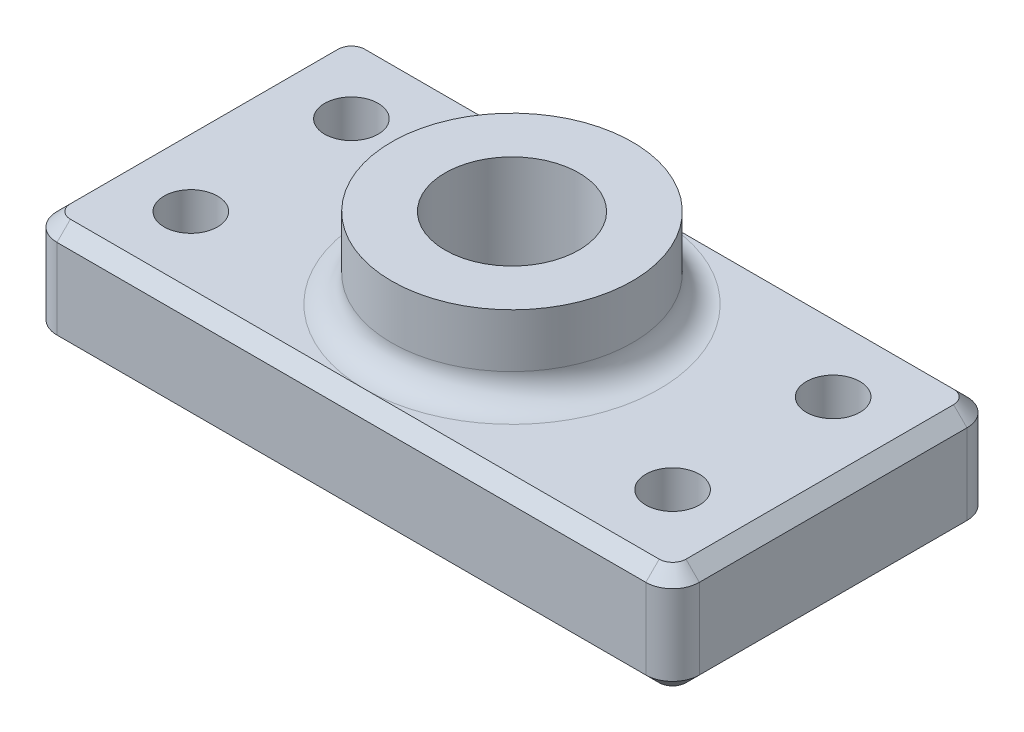
ISO-10303-21;
HEADER;
FILE_DESCRIPTION(('STEP AP214'),'2;1');
FILE_NAME('part.step','',(''),(''),'','','');
FILE_SCHEMA(('AUTOMOTIVE_DESIGN { 1 0 10303 214 1 1 1 1 }'));
ENDSEC;
DATA;
#1=APPLICATION_CONTEXT('core data for automotive mechanical design processes');
#2=APPLICATION_PROTOCOL_DEFINITION('international standard','automotive_design',2000,#1);
#3=PRODUCT_CONTEXT('',#1,'mechanical');
#4=PRODUCT('Part','Part','',(#3));
#5=PRODUCT_RELATED_PRODUCT_CATEGORY('part','',(#4));
#6=PRODUCT_DEFINITION_FORMATION('','',#4);
#7=PRODUCT_DEFINITION_CONTEXT('part definition',#1,'design');
#8=PRODUCT_DEFINITION('design','',#6,#7);
#9=PRODUCT_DEFINITION_SHAPE('','',#8);
#10=(LENGTH_UNIT() NAMED_UNIT(*) SI_UNIT(.MILLI.,.METRE.));
#11=(NAMED_UNIT(*) PLANE_ANGLE_UNIT() SI_UNIT($,.RADIAN.));
#12=(NAMED_UNIT(*) SI_UNIT($,.STERADIAN.) SOLID_ANGLE_UNIT());
#13=UNCERTAINTY_MEASURE_WITH_UNIT(LENGTH_MEASURE(1.E-05),#10,'distance_accuracy_value','');
#14=(GEOMETRIC_REPRESENTATION_CONTEXT(3) GLOBAL_UNCERTAINTY_ASSIGNED_CONTEXT((#13)) GLOBAL_UNIT_ASSIGNED_CONTEXT((#10,
#11,#12)) REPRESENTATION_CONTEXT('',''));
#15=CARTESIAN_POINT('',(0.,0.,0.));
#16=DIRECTION('',(0.,0.,1.));
#17=DIRECTION('',(1.,0.,0.));
#18=AXIS2_PLACEMENT_3D('',#15,#16,#17);
#19=CARTESIAN_POINT('',(0.,1.,0.));
#20=DIRECTION('',(0.,1.,0.));
#21=DIRECTION('',(0.,0.,1.));
#22=AXIS2_PLACEMENT_3D('',#19,#20,#21);
#23=PLANE('',#22);
#24=CARTESIAN_POINT('',(2.25,1.,0.75));
#25=DIRECTION('',(0.,1.,0.));
#26=DIRECTION('',(0.,0.,1.));
#27=AXIS2_PLACEMENT_3D('',#24,#25,#26);
#28=CIRCLE('',#27,0.25);
#29=CARTESIAN_POINT('',(2.25,1.,1.));
#30=VERTEX_POINT('',#29);
#31=EDGE_CURVE('E400',#30,#30,#28,.T.);
#32=ORIENTED_EDGE('',*,*,#31,.F.);
#33=EDGE_LOOP('',(#32));
#34=FACE_BOUND('',#33,.T.);
#35=CARTESIAN_POINT('',(2.25,1.,-0.75));
#36=DIRECTION('',(0.,1.,0.));
#37=DIRECTION('',(0.,0.,1.));
#38=AXIS2_PLACEMENT_3D('',#35,#36,#37);
#39=CIRCLE('',#38,0.25);
#40=CARTESIAN_POINT('',(2.25,1.,-0.5));
#41=VERTEX_POINT('',#40);
#42=EDGE_CURVE('E417',#41,#41,#39,.T.);
#43=ORIENTED_EDGE('',*,*,#42,.F.);
#44=EDGE_LOOP('',(#43));
#45=FACE_BOUND('',#44,.T.);
#46=CARTESIAN_POINT('',(2.75,1.,-1.25));
#47=DIRECTION('',(0.,1.,0.));
#48=DIRECTION('',(0.,0.,1.));
#49=AXIS2_PLACEMENT_3D('',#46,#47,#48);
#50=CIRCLE('',#49,0.125000000000001);
#51=CARTESIAN_POINT('',(2.875,1.,-1.25));
#52=VERTEX_POINT('',#51);
#53=CARTESIAN_POINT('',(2.75,1.,-1.375));
#54=VERTEX_POINT('',#53);
#55=EDGE_CURVE('E58',#52,#54,#50,.T.);
#56=ORIENTED_EDGE('',*,*,#55,.T.);
#57=DIRECTION('',(-1.,0.,0.));
#58=VECTOR('',#57,1.);
#59=CARTESIAN_POINT('',(-2.75,1.,-1.375));
#60=LINE('',#59,#58);
#61=CARTESIAN_POINT('',(0.,1.,-1.375));
#62=VERTEX_POINT('',#61);
#63=EDGE_CURVE('E11',#54,#62,#60,.T.);
#64=ORIENTED_EDGE('',*,*,#63,.T.);
#65=CARTESIAN_POINT('',(0.,1.,0.));
#66=DIRECTION('',(0.,1.,0.));
#67=DIRECTION('',(0.,0.,1.));
#68=AXIS2_PLACEMENT_3D('',#65,#66,#67);
#69=CIRCLE('',#68,1.375);
#70=CARTESIAN_POINT('',(0.,1.,1.375));
#71=VERTEX_POINT('',#70);
#72=EDGE_CURVE('E386',#62,#71,#69,.F.);
#73=ORIENTED_EDGE('',*,*,#72,.T.);
#74=DIRECTION('',(1.,0.,0.));
#75=VECTOR('',#74,1.);
#76=CARTESIAN_POINT('',(2.75,1.,1.375));
#77=LINE('',#76,#75);
#78=CARTESIAN_POINT('',(2.75,1.,1.375));
#79=VERTEX_POINT('',#78);
#80=EDGE_CURVE('E250',#71,#79,#77,.T.);
#81=ORIENTED_EDGE('',*,*,#80,.T.);
#82=CARTESIAN_POINT('',(2.75,1.,1.25));
#83=DIRECTION('',(0.,1.,0.));
#84=DIRECTION('',(0.,0.,1.));
#85=AXIS2_PLACEMENT_3D('',#82,#83,#84);
#86=CIRCLE('',#85,0.125000000000001);
#87=CARTESIAN_POINT('',(2.875,1.,1.25));
#88=VERTEX_POINT('',#87);
#89=EDGE_CURVE('E254',#79,#88,#86,.T.);
#90=ORIENTED_EDGE('',*,*,#89,.T.);
#91=DIRECTION('',(0.,0.,-1.));
#92=VECTOR('',#91,1.);
#93=CARTESIAN_POINT('',(2.875,1.,-1.25));
#94=LINE('',#93,#92);
#95=EDGE_CURVE('E258',#88,#52,#94,.T.);
#96=ORIENTED_EDGE('',*,*,#95,.T.);
#97=EDGE_LOOP('',(#56,#64,#73,#81,#90,#96));
#98=FACE_BOUND('',#97,.T.);
#99=ADVANCED_FACE('F35',(#34,#45,#98),#23,.T.);
#100=CARTESIAN_POINT('',(3.,1.,-1.5));
#101=DIRECTION('',(-1.,0.,0.));
#102=DIRECTION('',(0.,0.,1.));
#103=AXIS2_PLACEMENT_3D('',#100,#101,#102);
#104=PLANE('',#103);
#105=DIRECTION('',(0.,-1.,0.));
#106=VECTOR('',#105,1.);
#107=CARTESIAN_POINT('',(3.,1.,1.25));
#108=LINE('',#107,#106);
#109=CARTESIAN_POINT('',(3.,0.875000000000001,1.25));
#110=VERTEX_POINT('',#109);
#111=CARTESIAN_POINT('',(3.,0.125,1.25));
#112=VERTEX_POINT('',#111);
#113=EDGE_CURVE('E186',#110,#112,#108,.T.);
#114=ORIENTED_EDGE('',*,*,#113,.T.);
#115=DIRECTION('',(0.,0.,-1.));
#116=VECTOR('',#115,1.);
#117=CARTESIAN_POINT('',(3.,0.125,-1.5));
#118=LINE('',#117,#116);
#119=CARTESIAN_POINT('',(3.,0.125,-1.25));
#120=VERTEX_POINT('',#119);
#121=EDGE_CURVE('E160',#112,#120,#118,.T.);
#122=ORIENTED_EDGE('',*,*,#121,.T.);
#123=DIRECTION('',(0.,-1.,0.));
#124=VECTOR('',#123,1.);
#125=CARTESIAN_POINT('',(3.,1.,-1.25));
#126=LINE('',#125,#124);
#127=CARTESIAN_POINT('',(3.,0.875000000000001,-1.25));
#128=VERTEX_POINT('',#127);
#129=EDGE_CURVE('E183',#120,#128,#126,.F.);
#130=ORIENTED_EDGE('',*,*,#129,.T.);
#131=DIRECTION('',(0.,0.,1.));
#132=VECTOR('',#131,1.);
#133=CARTESIAN_POINT('',(3.,0.875000000000001,1.25));
#134=LINE('',#133,#132);
#135=EDGE_CURVE('E189',#128,#110,#134,.T.);
#136=ORIENTED_EDGE('',*,*,#135,.T.);
#137=EDGE_LOOP('',(#114,#122,#130,#136));
#138=FACE_BOUND('',#137,.T.);
#139=ADVANCED_FACE('F182',(#138),#104,.F.);
#140=CARTESIAN_POINT('',(-3.,1.,-1.5));
#141=DIRECTION('',(0.,0.,1.));
#142=DIRECTION('',(1.,0.,0.));
#143=AXIS2_PLACEMENT_3D('',#140,#141,#142);
#144=PLANE('',#143);
#145=DIRECTION('',(0.,-1.,0.));
#146=VECTOR('',#145,1.);
#147=CARTESIAN_POINT('',(2.75,1.,-1.5));
#148=LINE('',#147,#146);
#149=CARTESIAN_POINT('',(2.75,0.875000000000001,-1.5));
#150=VERTEX_POINT('',#149);
#151=CARTESIAN_POINT('',(2.75,0.125,-1.5));
#152=VERTEX_POINT('',#151);
#153=EDGE_CURVE('E198',#150,#152,#148,.T.);
#154=ORIENTED_EDGE('',*,*,#153,.T.);
#155=DIRECTION('',(-1.,0.,0.));
#156=VECTOR('',#155,1.);
#157=CARTESIAN_POINT('',(-3.,0.125,-1.5));
#158=LINE('',#157,#156);
#159=CARTESIAN_POINT('',(-2.75,0.125,-1.5));
#160=VERTEX_POINT('',#159);
#161=EDGE_CURVE('E232',#152,#160,#158,.T.);
#162=ORIENTED_EDGE('',*,*,#161,.T.);
#163=DIRECTION('',(0.,-1.,0.));
#164=VECTOR('',#163,1.);
#165=CARTESIAN_POINT('',(-2.75,1.,-1.5));
#166=LINE('',#165,#164);
#167=CARTESIAN_POINT('',(-2.75,0.875000000000001,-1.5));
#168=VERTEX_POINT('',#167);
#169=EDGE_CURVE('E354',#160,#168,#166,.F.);
#170=ORIENTED_EDGE('',*,*,#169,.T.);
#171=DIRECTION('',(1.,0.,0.));
#172=VECTOR('',#171,1.);
#173=CARTESIAN_POINT('',(2.75,0.875000000000001,-1.5));
#174=LINE('',#173,#172);
#175=EDGE_CURVE('E229',#168,#150,#174,.T.);
#176=ORIENTED_EDGE('',*,*,#175,.T.);
#177=EDGE_LOOP('',(#154,#162,#170,#176));
#178=FACE_BOUND('',#177,.T.);
#179=ADVANCED_FACE('F353',(#178),#144,.F.);
#180=CARTESIAN_POINT('',(-3.,1.,-1.5));
#181=DIRECTION('',(1.,0.,0.));
#182=DIRECTION('',(0.,0.,-1.));
#183=AXIS2_PLACEMENT_3D('',#180,#181,#182);
#184=PLANE('',#183);
#185=DIRECTION('',(0.,-1.,0.));
#186=VECTOR('',#185,1.);
#187=CARTESIAN_POINT('',(-3.,1.,-1.25));
#188=LINE('',#187,#186);
#189=CARTESIAN_POINT('',(-3.,0.875000000000001,-1.25));
#190=VERTEX_POINT('',#189);
#191=CARTESIAN_POINT('',(-3.,0.125,-1.25));
#192=VERTEX_POINT('',#191);
#193=EDGE_CURVE('E204',#190,#192,#188,.T.);
#194=ORIENTED_EDGE('',*,*,#193,.T.);
#195=DIRECTION('',(0.,0.,1.));
#196=VECTOR('',#195,1.);
#197=CARTESIAN_POINT('',(-3.,0.125,-1.5));
#198=LINE('',#197,#196);
#199=CARTESIAN_POINT('',(-3.,0.125,1.25));
#200=VERTEX_POINT('',#199);
#201=EDGE_CURVE('E248',#192,#200,#198,.T.);
#202=ORIENTED_EDGE('',*,*,#201,.T.);
#203=DIRECTION('',(0.,-1.,0.));
#204=VECTOR('',#203,1.);
#205=CARTESIAN_POINT('',(-3.,1.,1.25));
#206=LINE('',#205,#204);
#207=CARTESIAN_POINT('',(-3.,0.875000000000001,1.25));
#208=VERTEX_POINT('',#207);
#209=EDGE_CURVE('E207',#200,#208,#206,.F.);
#210=ORIENTED_EDGE('',*,*,#209,.T.);
#211=DIRECTION('',(0.,0.,-1.));
#212=VECTOR('',#211,1.);
#213=CARTESIAN_POINT('',(-3.,0.875000000000001,-1.25));
#214=LINE('',#213,#212);
#215=EDGE_CURVE('E246',#208,#190,#214,.T.);
#216=ORIENTED_EDGE('',*,*,#215,.T.);
#217=EDGE_LOOP('',(#194,#202,#210,#216));
#218=FACE_BOUND('',#217,.T.);
#219=ADVANCED_FACE('F371',(#218),#184,.F.);
#220=CARTESIAN_POINT('',(-3.,1.,1.5));
#221=DIRECTION('',(0.,0.,-1.));
#222=DIRECTION('',(-1.,0.,0.));
#223=AXIS2_PLACEMENT_3D('',#220,#221,#222);
#224=PLANE('',#223);
#225=DIRECTION('',(0.,-1.,0.));
#226=VECTOR('',#225,1.);
#227=CARTESIAN_POINT('',(-2.75,1.,1.5));
#228=LINE('',#227,#226);
#229=CARTESIAN_POINT('',(-2.75,0.875000000000001,1.5));
#230=VERTEX_POINT('',#229);
#231=CARTESIAN_POINT('',(-2.75,0.125,1.5));
#232=VERTEX_POINT('',#231);
#233=EDGE_CURVE('E193',#230,#232,#228,.T.);
#234=ORIENTED_EDGE('',*,*,#233,.T.);
#235=DIRECTION('',(1.,0.,0.));
#236=VECTOR('',#235,1.);
#237=CARTESIAN_POINT('',(-3.,0.125,1.5));
#238=LINE('',#237,#236);
#239=CARTESIAN_POINT('',(2.75,0.125,1.5));
#240=VERTEX_POINT('',#239);
#241=EDGE_CURVE('E236',#232,#240,#238,.T.);
#242=ORIENTED_EDGE('',*,*,#241,.T.);
#243=DIRECTION('',(0.,-1.,0.));
#244=VECTOR('',#243,1.);
#245=CARTESIAN_POINT('',(2.75,1.,1.5));
#246=LINE('',#245,#244);
#247=CARTESIAN_POINT('',(2.75,0.875000000000001,1.5));
#248=VERTEX_POINT('',#247);
#249=EDGE_CURVE('E196',#240,#248,#246,.F.);
#250=ORIENTED_EDGE('',*,*,#249,.T.);
#251=DIRECTION('',(-1.,0.,0.));
#252=VECTOR('',#251,1.);
#253=CARTESIAN_POINT('',(-2.75,0.875000000000001,1.5));
#254=LINE('',#253,#252);
#255=EDGE_CURVE('E234',#248,#230,#254,.T.);
#256=ORIENTED_EDGE('',*,*,#255,.T.);
#257=EDGE_LOOP('',(#234,#242,#250,#256));
#258=FACE_BOUND('',#257,.T.);
#259=ADVANCED_FACE('F319',(#258),#224,.F.);
#260=CARTESIAN_POINT('',(-2.25,1.,0.75));
#261=DIRECTION('',(0.,1.,0.));
#262=DIRECTION('',(0.,0.,1.));
#263=AXIS2_PLACEMENT_3D('',#260,#261,#262);
#264=CIRCLE('',#263,0.25);
#265=CARTESIAN_POINT('',(-2.25,1.,1.));
#266=VERTEX_POINT('',#265);
#267=EDGE_CURVE('E283',#266,#266,#264,.T.);
#268=ORIENTED_EDGE('',*,*,#267,.F.);
#269=EDGE_LOOP('',(#268));
#270=FACE_BOUND('',#269,.T.);
#271=CARTESIAN_POINT('',(-2.25,1.,-0.75));
#272=DIRECTION('',(0.,1.,0.));
#273=DIRECTION('',(0.,0.,1.));
#274=AXIS2_PLACEMENT_3D('',#271,#272,#273);
#275=CIRCLE('',#274,0.25);
#276=CARTESIAN_POINT('',(-2.25,1.,-0.5));
#277=VERTEX_POINT('',#276);
#278=EDGE_CURVE('E411',#277,#277,#275,.T.);
#279=ORIENTED_EDGE('',*,*,#278,.F.);
#280=EDGE_LOOP('',(#279));
#281=FACE_BOUND('',#280,.T.);
#282=EDGE_CURVE('E361',#71,#62,#69,.F.);
#283=ORIENTED_EDGE('',*,*,#282,.T.);
#284=DIRECTION('',(-1.,0.,0.));
#285=VECTOR('',#284,1.);
#286=CARTESIAN_POINT('',(-2.75,1.,-1.375));
#287=LINE('',#286,#285);
#288=CARTESIAN_POINT('',(-2.75,1.,-1.375));
#289=VERTEX_POINT('',#288);
#290=EDGE_CURVE('E44',#62,#289,#287,.T.);
#291=ORIENTED_EDGE('',*,*,#290,.T.);
#292=CARTESIAN_POINT('',(-2.75,1.,-1.25));
#293=DIRECTION('',(0.,1.,0.));
#294=DIRECTION('',(0.,0.,1.));
#295=AXIS2_PLACEMENT_3D('',#292,#293,#294);
#296=CIRCLE('',#295,0.125000000000001);
#297=CARTESIAN_POINT('',(-2.875,1.,-1.25));
#298=VERTEX_POINT('',#297);
#299=EDGE_CURVE('E263',#289,#298,#296,.T.);
#300=ORIENTED_EDGE('',*,*,#299,.T.);
#301=DIRECTION('',(0.,0.,1.));
#302=VECTOR('',#301,1.);
#303=CARTESIAN_POINT('',(-2.875,1.,1.25));
#304=LINE('',#303,#302);
#305=CARTESIAN_POINT('',(-2.875,1.,1.25));
#306=VERTEX_POINT('',#305);
#307=EDGE_CURVE('E260',#298,#306,#304,.T.);
#308=ORIENTED_EDGE('',*,*,#307,.T.);
#309=CARTESIAN_POINT('',(-2.75,1.,1.25));
#310=DIRECTION('',(0.,1.,0.));
#311=DIRECTION('',(0.,0.,1.));
#312=AXIS2_PLACEMENT_3D('',#309,#310,#311);
#313=CIRCLE('',#312,0.125000000000001);
#314=CARTESIAN_POINT('',(-2.75,1.,1.375));
#315=VERTEX_POINT('',#314);
#316=EDGE_CURVE('E256',#306,#315,#313,.T.);
#317=ORIENTED_EDGE('',*,*,#316,.T.);
#318=DIRECTION('',(1.,0.,0.));
#319=VECTOR('',#318,1.);
#320=CARTESIAN_POINT('',(2.75,1.,1.375));
#321=LINE('',#320,#319);
#322=EDGE_CURVE('E252',#315,#71,#321,.T.);
#323=ORIENTED_EDGE('',*,*,#322,.T.);
#324=EDGE_LOOP('',(#283,#291,#300,#308,#317,#323));
#325=FACE_BOUND('',#324,.T.);
#326=ADVANCED_FACE('F436',(#270,#281,#325),#23,.T.);
#327=CARTESIAN_POINT('',(0.,0.,0.));
#328=DIRECTION('',(0.,1.,0.));
#329=DIRECTION('',(0.,0.,1.));
#330=AXIS2_PLACEMENT_3D('',#327,#328,#329);
#331=PLANE('',#330);
#332=CARTESIAN_POINT('',(2.75,0.,-1.25));
#333=DIRECTION('',(0.,1.,0.));
#334=DIRECTION('',(0.,0.,1.));
#335=AXIS2_PLACEMENT_3D('',#332,#333,#334);
#336=CIRCLE('',#335,0.124999999999999);
#337=CARTESIAN_POINT('',(2.75,0.,-1.375));
#338=VERTEX_POINT('',#337);
#339=CARTESIAN_POINT('',(2.875,0.,-1.25));
#340=VERTEX_POINT('',#339);
#341=EDGE_CURVE('E222',#338,#340,#336,.F.);
#342=ORIENTED_EDGE('',*,*,#341,.T.);
#343=DIRECTION('',(0.,0.,1.));
#344=VECTOR('',#343,1.);
#345=CARTESIAN_POINT('',(2.875,0.,0.));
#346=LINE('',#345,#344);
#347=CARTESIAN_POINT('',(2.875,0.,1.25));
#348=VERTEX_POINT('',#347);
#349=EDGE_CURVE('E162',#340,#348,#346,.T.);
#350=ORIENTED_EDGE('',*,*,#349,.T.);
#351=CARTESIAN_POINT('',(2.75,0.,1.25));
#352=DIRECTION('',(0.,1.,0.));
#353=DIRECTION('',(0.,0.,1.));
#354=AXIS2_PLACEMENT_3D('',#351,#352,#353);
#355=CIRCLE('',#354,0.124999999999999);
#356=CARTESIAN_POINT('',(2.75,0.,1.375));
#357=VERTEX_POINT('',#356);
#358=EDGE_CURVE('E220',#348,#357,#355,.F.);
#359=ORIENTED_EDGE('',*,*,#358,.T.);
#360=DIRECTION('',(-1.,0.,0.));
#361=VECTOR('',#360,1.);
#362=CARTESIAN_POINT('',(0.,0.,1.375));
#363=LINE('',#362,#361);
#364=CARTESIAN_POINT('',(-2.75,0.,1.375));
#365=VERTEX_POINT('',#364);
#366=EDGE_CURVE('E216',#357,#365,#363,.T.);
#367=ORIENTED_EDGE('',*,*,#366,.T.);
#368=CARTESIAN_POINT('',(-2.75,0.,1.25));
#369=DIRECTION('',(0.,1.,0.));
#370=DIRECTION('',(0.,0.,1.));
#371=AXIS2_PLACEMENT_3D('',#368,#369,#370);
#372=CIRCLE('',#371,0.124999999999999);
#373=CARTESIAN_POINT('',(-2.875,0.,1.25));
#374=VERTEX_POINT('',#373);
#375=EDGE_CURVE('E212',#365,#374,#372,.F.);
#376=ORIENTED_EDGE('',*,*,#375,.T.);
#377=DIRECTION('',(0.,0.,-1.));
#378=VECTOR('',#377,1.);
#379=CARTESIAN_POINT('',(-2.875,0.,0.));
#380=LINE('',#379,#378);
#381=CARTESIAN_POINT('',(-2.875,0.,-1.25));
#382=VERTEX_POINT('',#381);
#383=EDGE_CURVE('E188',#374,#382,#380,.T.);
#384=ORIENTED_EDGE('',*,*,#383,.T.);
#385=CARTESIAN_POINT('',(-2.75,0.,-1.25));
#386=DIRECTION('',(0.,1.,0.));
#387=DIRECTION('',(0.,0.,1.));
#388=AXIS2_PLACEMENT_3D('',#385,#386,#387);
#389=CIRCLE('',#388,0.124999999999999);
#390=CARTESIAN_POINT('',(-2.75,0.,-1.375));
#391=VERTEX_POINT('',#390);
#392=EDGE_CURVE('E214',#382,#391,#389,.F.);
#393=ORIENTED_EDGE('',*,*,#392,.T.);
#394=DIRECTION('',(1.,0.,0.));
#395=VECTOR('',#394,1.);
#396=CARTESIAN_POINT('',(0.,0.,-1.375));
#397=LINE('',#396,#395);
#398=EDGE_CURVE('E218',#391,#338,#397,.T.);
#399=ORIENTED_EDGE('',*,*,#398,.T.);
#400=EDGE_LOOP('',(#342,#350,#359,#367,#376,#384,#393,#399));
#401=FACE_BOUND('',#400,.T.);
#402=CARTESIAN_POINT('',(-2.25,0.,0.75));
#403=DIRECTION('',(0.,1.,0.));
#404=DIRECTION('',(0.,0.,1.));
#405=AXIS2_PLACEMENT_3D('',#402,#403,#404);
#406=CIRCLE('',#405,0.25);
#407=CARTESIAN_POINT('',(-2.25,0.,1.));
#408=VERTEX_POINT('',#407);
#409=EDGE_CURVE('E408',#408,#408,#406,.T.);
#410=ORIENTED_EDGE('',*,*,#409,.T.);
#411=EDGE_LOOP('',(#410));
#412=FACE_BOUND('',#411,.T.);
#413=CARTESIAN_POINT('',(-2.25,0.,-0.75));
#414=DIRECTION('',(0.,1.,0.));
#415=DIRECTION('',(0.,0.,1.));
#416=AXIS2_PLACEMENT_3D('',#413,#414,#415);
#417=CIRCLE('',#416,0.25);
#418=CARTESIAN_POINT('',(-2.25,0.,-0.5));
#419=VERTEX_POINT('',#418);
#420=EDGE_CURVE('E414',#419,#419,#417,.T.);
#421=ORIENTED_EDGE('',*,*,#420,.T.);
#422=EDGE_LOOP('',(#421));
#423=FACE_BOUND('',#422,.T.);
#424=CARTESIAN_POINT('',(2.25,0.,-0.75));
#425=DIRECTION('',(0.,1.,0.));
#426=DIRECTION('',(0.,0.,1.));
#427=AXIS2_PLACEMENT_3D('',#424,#425,#426);
#428=CIRCLE('',#427,0.25);
#429=CARTESIAN_POINT('',(2.25,0.,-0.5));
#430=VERTEX_POINT('',#429);
#431=EDGE_CURVE('E403',#430,#430,#428,.T.);
#432=ORIENTED_EDGE('',*,*,#431,.T.);
#433=EDGE_LOOP('',(#432));
#434=FACE_BOUND('',#433,.T.);
#435=CARTESIAN_POINT('',(2.25,0.,0.75));
#436=DIRECTION('',(0.,1.,0.));
#437=DIRECTION('',(0.,0.,1.));
#438=AXIS2_PLACEMENT_3D('',#435,#436,#437);
#439=CIRCLE('',#438,0.25);
#440=CARTESIAN_POINT('',(2.25,0.,1.));
#441=VERTEX_POINT('',#440);
#442=EDGE_CURVE('E397',#441,#441,#439,.T.);
#443=ORIENTED_EDGE('',*,*,#442,.T.);
#444=EDGE_LOOP('',(#443));
#445=FACE_BOUND('',#444,.T.);
#446=CARTESIAN_POINT('',(0.,0.,0.));
#447=DIRECTION('',(0.,1.,0.));
#448=DIRECTION('',(0.,0.,1.));
#449=AXIS2_PLACEMENT_3D('',#446,#447,#448);
#450=CIRCLE('',#449,0.625);
#451=CARTESIAN_POINT('',(0.,0.,0.625));
#452=VERTEX_POINT('',#451);
#453=EDGE_CURVE('E394',#452,#452,#450,.T.);
#454=ORIENTED_EDGE('',*,*,#453,.T.);
#455=EDGE_LOOP('',(#454));
#456=FACE_BOUND('',#455,.T.);
#457=ADVANCED_FACE('F342',(#401,#412,#423,#434,#445,#456),#331,.F.);
#458=CARTESIAN_POINT('',(0.,1.75,0.));
#459=DIRECTION('',(0.,-1.,0.));
#460=DIRECTION('',(0.,0.,-1.));
#461=AXIS2_PLACEMENT_3D('',#458,#459,#460);
#462=CYLINDRICAL_SURFACE('',#461,1.125);
#463=CARTESIAN_POINT('',(0.,1.25,0.));
#464=DIRECTION('',(0.,1.,0.));
#465=DIRECTION('',(0.,0.,1.));
#466=AXIS2_PLACEMENT_3D('',#463,#464,#465);
#467=CIRCLE('',#466,1.125);
#468=CARTESIAN_POINT('',(0.,1.25,1.125));
#469=VERTEX_POINT('',#468);
#470=EDGE_CURVE('E387',#469,#469,#467,.T.);
#471=ORIENTED_EDGE('',*,*,#470,.T.);
#472=EDGE_LOOP('',(#471));
#473=FACE_BOUND('',#472,.T.);
#474=CARTESIAN_POINT('',(0.,1.75,0.));
#475=DIRECTION('',(0.,1.,0.));
#476=DIRECTION('',(0.,0.,1.));
#477=AXIS2_PLACEMENT_3D('',#474,#475,#476);
#478=CIRCLE('',#477,1.125);
#479=CARTESIAN_POINT('',(0.,1.75,1.125));
#480=VERTEX_POINT('',#479);
#481=EDGE_CURVE('E390',#480,#480,#478,.T.);
#482=ORIENTED_EDGE('',*,*,#481,.F.);
#483=EDGE_LOOP('',(#482));
#484=FACE_BOUND('',#483,.T.);
#485=ADVANCED_FACE('F450',(#473,#484),#462,.T.);
#486=CARTESIAN_POINT('',(0.,1.75,0.));
#487=DIRECTION('',(0.,1.,0.));
#488=DIRECTION('',(0.,0.,1.));
#489=AXIS2_PLACEMENT_3D('',#486,#487,#488);
#490=PLANE('',#489);
#491=CARTESIAN_POINT('',(0.,1.75,0.));
#492=DIRECTION('',(0.,1.,0.));
#493=DIRECTION('',(0.,0.,1.));
#494=AXIS2_PLACEMENT_3D('',#491,#492,#493);
#495=CIRCLE('',#494,0.625);
#496=CARTESIAN_POINT('',(0.,1.75,0.625));
#497=VERTEX_POINT('',#496);
#498=EDGE_CURVE('E393',#497,#497,#495,.T.);
#499=ORIENTED_EDGE('',*,*,#498,.F.);
#500=EDGE_LOOP('',(#499));
#501=FACE_BOUND('',#500,.T.);
#502=ORIENTED_EDGE('',*,*,#481,.T.);
#503=EDGE_LOOP('',(#502));
#504=FACE_BOUND('',#503,.T.);
#505=ADVANCED_FACE('F716',(#501,#504),#490,.T.);
#506=CARTESIAN_POINT('',(0.,1.75,0.));
#507=DIRECTION('',(0.,-1.,0.));
#508=DIRECTION('',(0.,0.,-1.));
#509=AXIS2_PLACEMENT_3D('',#506,#507,#508);
#510=CYLINDRICAL_SURFACE('',#509,0.625);
#511=ORIENTED_EDGE('',*,*,#498,.T.);
#512=EDGE_LOOP('',(#511));
#513=FACE_BOUND('',#512,.T.);
#514=ORIENTED_EDGE('',*,*,#453,.F.);
#515=EDGE_LOOP('',(#514));
#516=FACE_BOUND('',#515,.T.);
#517=ADVANCED_FACE('F633',(#513,#516),#510,.F.);
#518=CARTESIAN_POINT('',(0.,1.25,0.));
#519=DIRECTION('',(0.,1.,0.));
#520=DIRECTION('',(0.,0.,1.));
#521=AXIS2_PLACEMENT_3D('',#518,#519,#520);
#522=TOROIDAL_SURFACE('',#521,1.375,0.25);
#523=ORIENTED_EDGE('',*,*,#282,.F.);
#524=ORIENTED_EDGE('',*,*,#72,.F.);
#525=EDGE_LOOP('',(#523,#524));
#526=FACE_BOUND('',#525,.T.);
#527=ORIENTED_EDGE('',*,*,#470,.F.);
#528=EDGE_LOOP('',(#527));
#529=FACE_BOUND('',#528,.T.);
#530=ADVANCED_FACE('F459',(#526,#529),#522,.F.);
#531=CARTESIAN_POINT('',(2.25,0.,0.75));
#532=DIRECTION('',(0.,1.,0.));
#533=DIRECTION('',(0.,0.,1.));
#534=AXIS2_PLACEMENT_3D('',#531,#532,#533);
#535=CYLINDRICAL_SURFACE('',#534,0.25);
#536=ORIENTED_EDGE('',*,*,#442,.F.);
#537=EDGE_LOOP('',(#536));
#538=FACE_BOUND('',#537,.T.);
#539=ORIENTED_EDGE('',*,*,#31,.T.);
#540=EDGE_LOOP('',(#539));
#541=FACE_BOUND('',#540,.T.);
#542=ADVANCED_FACE('F429',(#538,#541),#535,.F.);
#543=CARTESIAN_POINT('',(2.25,0.,-0.75));
#544=DIRECTION('',(0.,1.,0.));
#545=DIRECTION('',(0.,0.,1.));
#546=AXIS2_PLACEMENT_3D('',#543,#544,#545);
#547=CYLINDRICAL_SURFACE('',#546,0.25);
#548=ORIENTED_EDGE('',*,*,#431,.F.);
#549=EDGE_LOOP('',(#548));
#550=FACE_BOUND('',#549,.T.);
#551=ORIENTED_EDGE('',*,*,#42,.T.);
#552=EDGE_LOOP('',(#551));
#553=FACE_BOUND('',#552,.T.);
#554=ADVANCED_FACE('F425',(#550,#553),#547,.F.);
#555=CARTESIAN_POINT('',(-2.25,0.,-0.75));
#556=DIRECTION('',(0.,1.,0.));
#557=DIRECTION('',(0.,0.,1.));
#558=AXIS2_PLACEMENT_3D('',#555,#556,#557);
#559=CYLINDRICAL_SURFACE('',#558,0.25);
#560=ORIENTED_EDGE('',*,*,#420,.F.);
#561=EDGE_LOOP('',(#560));
#562=FACE_BOUND('',#561,.T.);
#563=ORIENTED_EDGE('',*,*,#278,.T.);
#564=EDGE_LOOP('',(#563));
#565=FACE_BOUND('',#564,.T.);
#566=ADVANCED_FACE('F428',(#562,#565),#559,.F.);
#567=CARTESIAN_POINT('',(-2.25,0.,0.75));
#568=DIRECTION('',(0.,1.,0.));
#569=DIRECTION('',(0.,0.,1.));
#570=AXIS2_PLACEMENT_3D('',#567,#568,#569);
#571=CYLINDRICAL_SURFACE('',#570,0.25);
#572=ORIENTED_EDGE('',*,*,#409,.F.);
#573=EDGE_LOOP('',(#572));
#574=FACE_BOUND('',#573,.T.);
#575=ORIENTED_EDGE('',*,*,#267,.T.);
#576=EDGE_LOOP('',(#575));
#577=FACE_BOUND('',#576,.T.);
#578=ADVANCED_FACE('F622',(#574,#577),#571,.F.);
#579=CARTESIAN_POINT('',(2.75,1.,-1.25));
#580=DIRECTION('',(0.,-1.,0.));
#581=DIRECTION('',(0.,0.,-1.));
#582=AXIS2_PLACEMENT_3D('',#579,#580,#581);
#583=CYLINDRICAL_SURFACE('',#582,0.25);
#584=ORIENTED_EDGE('',*,*,#129,.F.);
#585=CARTESIAN_POINT('',(2.75,0.125,-1.25));
#586=DIRECTION('',(0.,1.,0.));
#587=DIRECTION('',(0.,0.,1.));
#588=AXIS2_PLACEMENT_3D('',#585,#586,#587);
#589=CIRCLE('',#588,0.25);
#590=EDGE_CURVE('E168',#120,#152,#589,.T.);
#591=ORIENTED_EDGE('',*,*,#590,.T.);
#592=ORIENTED_EDGE('',*,*,#153,.F.);
#593=CARTESIAN_POINT('',(2.75,0.875000000000001,-1.25));
#594=DIRECTION('',(0.,1.,0.));
#595=DIRECTION('',(0.,0.,1.));
#596=AXIS2_PLACEMENT_3D('',#593,#594,#595);
#597=CIRCLE('',#596,0.25);
#598=EDGE_CURVE('E177',#150,#128,#597,.F.);
#599=ORIENTED_EDGE('',*,*,#598,.T.);
#600=EDGE_LOOP('',(#584,#591,#592,#599));
#601=FACE_BOUND('',#600,.T.);
#602=ADVANCED_FACE('F191',(#601),#583,.T.);
#603=CARTESIAN_POINT('',(2.75,1.,1.25));
#604=DIRECTION('',(0.,-1.,0.));
#605=DIRECTION('',(0.,0.,-1.));
#606=AXIS2_PLACEMENT_3D('',#603,#604,#605);
#607=CYLINDRICAL_SURFACE('',#606,0.25);
#608=ORIENTED_EDGE('',*,*,#249,.F.);
#609=CARTESIAN_POINT('',(2.75,0.125,1.25));
#610=DIRECTION('',(0.,1.,0.));
#611=DIRECTION('',(0.,0.,1.));
#612=AXIS2_PLACEMENT_3D('',#609,#610,#611);
#613=CIRCLE('',#612,0.25);
#614=EDGE_CURVE('E227',#240,#112,#613,.T.);
#615=ORIENTED_EDGE('',*,*,#614,.T.);
#616=ORIENTED_EDGE('',*,*,#113,.F.);
#617=CARTESIAN_POINT('',(2.75,0.875000000000001,1.25));
#618=DIRECTION('',(0.,1.,0.));
#619=DIRECTION('',(0.,0.,1.));
#620=AXIS2_PLACEMENT_3D('',#617,#618,#619);
#621=CIRCLE('',#620,0.25);
#622=EDGE_CURVE('E176',#110,#248,#621,.F.);
#623=ORIENTED_EDGE('',*,*,#622,.T.);
#624=EDGE_LOOP('',(#608,#615,#616,#623));
#625=FACE_BOUND('',#624,.T.);
#626=ADVANCED_FACE('F337',(#625),#607,.T.);
#627=CARTESIAN_POINT('',(-2.75,1.,1.25));
#628=DIRECTION('',(0.,-1.,0.));
#629=DIRECTION('',(0.,0.,-1.));
#630=AXIS2_PLACEMENT_3D('',#627,#628,#629);
#631=CYLINDRICAL_SURFACE('',#630,0.25);
#632=ORIENTED_EDGE('',*,*,#209,.F.);
#633=CARTESIAN_POINT('',(-2.75,0.125,1.25));
#634=DIRECTION('',(0.,1.,0.));
#635=DIRECTION('',(0.,0.,1.));
#636=AXIS2_PLACEMENT_3D('',#633,#634,#635);
#637=CIRCLE('',#636,0.25);
#638=EDGE_CURVE('E244',#200,#232,#637,.T.);
#639=ORIENTED_EDGE('',*,*,#638,.T.);
#640=ORIENTED_EDGE('',*,*,#233,.F.);
#641=CARTESIAN_POINT('',(-2.75,0.875000000000001,1.25));
#642=DIRECTION('',(0.,1.,0.));
#643=DIRECTION('',(0.,0.,1.));
#644=AXIS2_PLACEMENT_3D('',#641,#642,#643);
#645=CIRCLE('',#644,0.25);
#646=EDGE_CURVE('E242',#230,#208,#645,.F.);
#647=ORIENTED_EDGE('',*,*,#646,.T.);
#648=EDGE_LOOP('',(#632,#639,#640,#647));
#649=FACE_BOUND('',#648,.T.);
#650=ADVANCED_FACE('F324',(#649),#631,.T.);
#651=CARTESIAN_POINT('',(-2.75,1.,-1.25));
#652=DIRECTION('',(0.,-1.,0.));
#653=DIRECTION('',(0.,0.,-1.));
#654=AXIS2_PLACEMENT_3D('',#651,#652,#653);
#655=CYLINDRICAL_SURFACE('',#654,0.25);
#656=ORIENTED_EDGE('',*,*,#169,.F.);
#657=CARTESIAN_POINT('',(-2.75,0.125,-1.25));
#658=DIRECTION('',(0.,1.,0.));
#659=DIRECTION('',(0.,0.,1.));
#660=AXIS2_PLACEMENT_3D('',#657,#658,#659);
#661=CIRCLE('',#660,0.25);
#662=EDGE_CURVE('E240',#160,#192,#661,.T.);
#663=ORIENTED_EDGE('',*,*,#662,.T.);
#664=ORIENTED_EDGE('',*,*,#193,.F.);
#665=CARTESIAN_POINT('',(-2.75,0.875000000000001,-1.25));
#666=DIRECTION('',(0.,1.,0.));
#667=DIRECTION('',(0.,0.,1.));
#668=AXIS2_PLACEMENT_3D('',#665,#666,#667);
#669=CIRCLE('',#668,0.25);
#670=EDGE_CURVE('E238',#190,#168,#669,.F.);
#671=ORIENTED_EDGE('',*,*,#670,.T.);
#672=EDGE_LOOP('',(#656,#663,#664,#671));
#673=FACE_BOUND('',#672,.T.);
#674=ADVANCED_FACE('F358',(#673),#655,.T.);
#675=CARTESIAN_POINT('',(-3.,0.125,-1.5));
#676=DIRECTION('',(0.707106781186545,0.70710678118655,0.));
#677=DIRECTION('',(0.,0.,1.));
#678=AXIS2_PLACEMENT_3D('',#675,#676,#677);
#679=PLANE('',#678);
#680=DIRECTION('',(-0.70710678118655,0.707106781186545,0.));
#681=VECTOR('',#680,1.);
#682=CARTESIAN_POINT('',(-2.875,0.,-1.25));
#683=LINE('',#682,#681);
#684=EDGE_CURVE('E277',#382,#192,#683,.T.);
#685=ORIENTED_EDGE('',*,*,#684,.F.);
#686=ORIENTED_EDGE('',*,*,#383,.F.);
#687=DIRECTION('',(0.70710678118655,-0.707106781186545,0.));
#688=VECTOR('',#687,1.);
#689=CARTESIAN_POINT('',(-3.,0.125,1.25));
#690=LINE('',#689,#688);
#691=EDGE_CURVE('E280',#200,#374,#690,.T.);
#692=ORIENTED_EDGE('',*,*,#691,.F.);
#693=ORIENTED_EDGE('',*,*,#201,.F.);
#694=EDGE_LOOP('',(#685,#686,#692,#693));
#695=FACE_BOUND('',#694,.T.);
#696=ADVANCED_FACE('F369',(#695),#679,.F.);
#697=CARTESIAN_POINT('',(-2.75,0.,1.25));
#698=DIRECTION('',(0.,1.,0.));
#699=DIRECTION('',(0.,0.,1.));
#700=AXIS2_PLACEMENT_3D('',#697,#698,#699);
#701=CONICAL_SURFACE('',#700,0.124999999999999,0.785398163397451);
#702=ORIENTED_EDGE('',*,*,#691,.T.);
#703=ORIENTED_EDGE('',*,*,#375,.F.);
#704=DIRECTION('',(0.,-0.707106781186546,-0.707106781186549));
#705=VECTOR('',#704,1.);
#706=CARTESIAN_POINT('',(-2.75,0.125,1.5));
#707=LINE('',#706,#705);
#708=EDGE_CURVE('E274',#232,#365,#707,.T.);
#709=ORIENTED_EDGE('',*,*,#708,.F.);
#710=ORIENTED_EDGE('',*,*,#638,.F.);
#711=EDGE_LOOP('',(#702,#703,#709,#710));
#712=FACE_BOUND('',#711,.T.);
#713=ADVANCED_FACE('F328',(#712),#701,.T.);
#714=CARTESIAN_POINT('',(-2.75,0.,-1.25));
#715=DIRECTION('',(0.,1.,0.));
#716=DIRECTION('',(0.,0.,1.));
#717=AXIS2_PLACEMENT_3D('',#714,#715,#716);
#718=CONICAL_SURFACE('',#717,0.124999999999999,0.785398163397452);
#719=ORIENTED_EDGE('',*,*,#684,.T.);
#720=ORIENTED_EDGE('',*,*,#662,.F.);
#721=DIRECTION('',(0.,0.707106781186545,-0.70710678118655));
#722=VECTOR('',#721,1.);
#723=CARTESIAN_POINT('',(-2.75,0.,-1.375));
#724=LINE('',#723,#722);
#725=EDGE_CURVE('E271',#391,#160,#724,.T.);
#726=ORIENTED_EDGE('',*,*,#725,.F.);
#727=ORIENTED_EDGE('',*,*,#392,.F.);
#728=EDGE_LOOP('',(#719,#720,#726,#727));
#729=FACE_BOUND('',#728,.T.);
#730=ADVANCED_FACE('F364',(#729),#718,.T.);
#731=CARTESIAN_POINT('',(-3.,0.125,1.5));
#732=DIRECTION('',(0.,0.70710678118655,-0.707106781186545));
#733=DIRECTION('',(1.,0.,0.));
#734=AXIS2_PLACEMENT_3D('',#731,#732,#733);
#735=PLANE('',#734);
#736=ORIENTED_EDGE('',*,*,#708,.T.);
#737=ORIENTED_EDGE('',*,*,#366,.F.);
#738=DIRECTION('',(0.,-0.707106781186545,-0.70710678118655));
#739=VECTOR('',#738,1.);
#740=CARTESIAN_POINT('',(2.75,0.125,1.5));
#741=LINE('',#740,#739);
#742=EDGE_CURVE('E268',#240,#357,#741,.T.);
#743=ORIENTED_EDGE('',*,*,#742,.F.);
#744=ORIENTED_EDGE('',*,*,#241,.F.);
#745=EDGE_LOOP('',(#736,#737,#743,#744));
#746=FACE_BOUND('',#745,.T.);
#747=ADVANCED_FACE('F334',(#746),#735,.F.);
#748=CARTESIAN_POINT('',(-3.,0.125,-1.5));
#749=DIRECTION('',(0.,0.70710678118655,0.707106781186545));
#750=DIRECTION('',(-1.,0.,0.));
#751=AXIS2_PLACEMENT_3D('',#748,#749,#750);
#752=PLANE('',#751);
#753=ORIENTED_EDGE('',*,*,#725,.T.);
#754=ORIENTED_EDGE('',*,*,#161,.F.);
#755=DIRECTION('',(0.,0.707106781186545,-0.70710678118655));
#756=VECTOR('',#755,1.);
#757=CARTESIAN_POINT('',(2.75,0.,-1.375));
#758=LINE('',#757,#756);
#759=EDGE_CURVE('E171',#338,#152,#758,.T.);
#760=ORIENTED_EDGE('',*,*,#759,.F.);
#761=ORIENTED_EDGE('',*,*,#398,.F.);
#762=EDGE_LOOP('',(#753,#754,#760,#761));
#763=FACE_BOUND('',#762,.T.);
#764=ADVANCED_FACE('F349',(#763),#752,.F.);
#765=CARTESIAN_POINT('',(2.75,0.,1.25));
#766=DIRECTION('',(0.,1.,0.));
#767=DIRECTION('',(0.,0.,1.));
#768=AXIS2_PLACEMENT_3D('',#765,#766,#767);
#769=CONICAL_SURFACE('',#768,0.124999999999999,0.785398163397452);
#770=ORIENTED_EDGE('',*,*,#742,.T.);
#771=ORIENTED_EDGE('',*,*,#358,.F.);
#772=DIRECTION('',(-0.70710678118655,-0.707106781186545,0.));
#773=VECTOR('',#772,1.);
#774=CARTESIAN_POINT('',(3.,0.125,1.25));
#775=LINE('',#774,#773);
#776=EDGE_CURVE('E165',#112,#348,#775,.T.);
#777=ORIENTED_EDGE('',*,*,#776,.F.);
#778=ORIENTED_EDGE('',*,*,#614,.F.);
#779=EDGE_LOOP('',(#770,#771,#777,#778));
#780=FACE_BOUND('',#779,.T.);
#781=ADVANCED_FACE('F339',(#780),#769,.T.);
#782=CARTESIAN_POINT('',(2.75,0.,-1.25));
#783=DIRECTION('',(0.,1.,0.));
#784=DIRECTION('',(0.,0.,1.));
#785=AXIS2_PLACEMENT_3D('',#782,#783,#784);
#786=CONICAL_SURFACE('',#785,0.124999999999999,0.785398163397451);
#787=ORIENTED_EDGE('',*,*,#759,.T.);
#788=ORIENTED_EDGE('',*,*,#590,.F.);
#789=DIRECTION('',(0.70710678118655,0.707106781186545,0.));
#790=VECTOR('',#789,1.);
#791=CARTESIAN_POINT('',(2.875,0.,-1.25));
#792=LINE('',#791,#790);
#793=EDGE_CURVE('E156',#340,#120,#792,.T.);
#794=ORIENTED_EDGE('',*,*,#793,.F.);
#795=ORIENTED_EDGE('',*,*,#341,.F.);
#796=EDGE_LOOP('',(#787,#788,#794,#795));
#797=FACE_BOUND('',#796,.T.);
#798=ADVANCED_FACE('F169',(#797),#786,.T.);
#799=CARTESIAN_POINT('',(3.,0.125,-1.5));
#800=DIRECTION('',(-0.707106781186545,0.70710678118655,0.));
#801=DIRECTION('',(0.,0.,-1.));
#802=AXIS2_PLACEMENT_3D('',#799,#800,#801);
#803=PLANE('',#802);
#804=ORIENTED_EDGE('',*,*,#776,.T.);
#805=ORIENTED_EDGE('',*,*,#349,.F.);
#806=ORIENTED_EDGE('',*,*,#793,.T.);
#807=ORIENTED_EDGE('',*,*,#121,.F.);
#808=EDGE_LOOP('',(#804,#805,#806,#807));
#809=FACE_BOUND('',#808,.T.);
#810=ADVANCED_FACE('F158',(#809),#803,.F.);
#811=CARTESIAN_POINT('',(0.,1.,1.375));
#812=DIRECTION('',(0.,0.707106781186547,0.707106781186547));
#813=DIRECTION('',(-1.,0.,0.));
#814=AXIS2_PLACEMENT_3D('',#811,#812,#813);
#815=PLANE('',#814);
#816=DIRECTION('',(0.,0.707106781186547,-0.707106781186547));
#817=VECTOR('',#816,1.);
#818=CARTESIAN_POINT('',(-2.75,0.875000000000001,1.5));
#819=LINE('',#818,#817);
#820=EDGE_CURVE('E300',#230,#315,#819,.T.);
#821=ORIENTED_EDGE('',*,*,#820,.F.);
#822=ORIENTED_EDGE('',*,*,#255,.F.);
#823=DIRECTION('',(0.,-0.707106781186547,0.707106781186547));
#824=VECTOR('',#823,1.);
#825=CARTESIAN_POINT('',(2.75,1.,1.375));
#826=LINE('',#825,#824);
#827=EDGE_CURVE('E39',#79,#248,#826,.T.);
#828=ORIENTED_EDGE('',*,*,#827,.F.);
#829=ORIENTED_EDGE('',*,*,#80,.F.);
#830=ORIENTED_EDGE('',*,*,#322,.F.);
#831=EDGE_LOOP('',(#821,#822,#828,#829,#830));
#832=FACE_BOUND('',#831,.T.);
#833=ADVANCED_FACE('F37',(#832),#815,.T.);
#834=CARTESIAN_POINT('',(2.75,1.,1.25));
#835=DIRECTION('',(0.,-1.,0.));
#836=DIRECTION('',(0.,0.,-1.));
#837=AXIS2_PLACEMENT_3D('',#834,#835,#836);
#838=CONICAL_SURFACE('',#837,0.125000000000001,0.785398163397448);
#839=ORIENTED_EDGE('',*,*,#827,.T.);
#840=ORIENTED_EDGE('',*,*,#622,.F.);
#841=DIRECTION('',(0.707106781186549,-0.707106781186546,0.));
#842=VECTOR('',#841,1.);
#843=CARTESIAN_POINT('',(2.875,1.,1.25));
#844=LINE('',#843,#842);
#845=EDGE_CURVE('E298',#88,#110,#844,.T.);
#846=ORIENTED_EDGE('',*,*,#845,.F.);
#847=ORIENTED_EDGE('',*,*,#89,.F.);
#848=EDGE_LOOP('',(#839,#840,#846,#847));
#849=FACE_BOUND('',#848,.T.);
#850=ADVANCED_FACE('F311',(#849),#838,.T.);
#851=CARTESIAN_POINT('',(-2.75,1.,1.25));
#852=DIRECTION('',(0.,-1.,0.));
#853=DIRECTION('',(0.,0.,-1.));
#854=AXIS2_PLACEMENT_3D('',#851,#852,#853);
#855=CONICAL_SURFACE('',#854,0.125000000000001,0.785398163397447);
#856=ORIENTED_EDGE('',*,*,#820,.T.);
#857=ORIENTED_EDGE('',*,*,#316,.F.);
#858=DIRECTION('',(0.707106781186547,0.707106781186547,0.));
#859=VECTOR('',#858,1.);
#860=CARTESIAN_POINT('',(-3.,0.875000000000001,1.25));
#861=LINE('',#860,#859);
#862=EDGE_CURVE('E295',#208,#306,#861,.T.);
#863=ORIENTED_EDGE('',*,*,#862,.F.);
#864=ORIENTED_EDGE('',*,*,#646,.F.);
#865=EDGE_LOOP('',(#856,#857,#863,#864));
#866=FACE_BOUND('',#865,.T.);
#867=ADVANCED_FACE('F479',(#866),#855,.T.);
#868=CARTESIAN_POINT('',(2.875,1.,0.));
#869=DIRECTION('',(0.707106781186547,0.707106781186547,0.));
#870=DIRECTION('',(0.,0.,1.));
#871=AXIS2_PLACEMENT_3D('',#868,#869,#870);
#872=PLANE('',#871);
#873=ORIENTED_EDGE('',*,*,#845,.T.);
#874=ORIENTED_EDGE('',*,*,#135,.F.);
#875=DIRECTION('',(0.707106781186547,-0.707106781186547,0.));
#876=VECTOR('',#875,1.);
#877=CARTESIAN_POINT('',(2.875,1.,-1.25));
#878=LINE('',#877,#876);
#879=EDGE_CURVE('E292',#52,#128,#878,.T.);
#880=ORIENTED_EDGE('',*,*,#879,.F.);
#881=ORIENTED_EDGE('',*,*,#95,.F.);
#882=EDGE_LOOP('',(#873,#874,#880,#881));
#883=FACE_BOUND('',#882,.T.);
#884=ADVANCED_FACE('F464',(#883),#872,.T.);
#885=CARTESIAN_POINT('',(-2.875,1.,0.));
#886=DIRECTION('',(-0.707106781186547,0.707106781186547,0.));
#887=DIRECTION('',(0.,0.,-1.));
#888=AXIS2_PLACEMENT_3D('',#885,#886,#887);
#889=PLANE('',#888);
#890=ORIENTED_EDGE('',*,*,#862,.T.);
#891=ORIENTED_EDGE('',*,*,#307,.F.);
#892=DIRECTION('',(0.707106781186547,0.707106781186547,0.));
#893=VECTOR('',#892,1.);
#894=CARTESIAN_POINT('',(-3.,0.875000000000001,-1.25));
#895=LINE('',#894,#893);
#896=EDGE_CURVE('E289',#190,#298,#895,.T.);
#897=ORIENTED_EDGE('',*,*,#896,.F.);
#898=ORIENTED_EDGE('',*,*,#215,.F.);
#899=EDGE_LOOP('',(#890,#891,#897,#898));
#900=FACE_BOUND('',#899,.T.);
#901=ADVANCED_FACE('F377',(#900),#889,.T.);
#902=CARTESIAN_POINT('',(2.75,1.,-1.25));
#903=DIRECTION('',(0.,-1.,0.));
#904=DIRECTION('',(0.,0.,-1.));
#905=AXIS2_PLACEMENT_3D('',#902,#903,#904);
#906=CONICAL_SURFACE('',#905,0.125000000000001,0.785398163397447);
#907=ORIENTED_EDGE('',*,*,#879,.T.);
#908=ORIENTED_EDGE('',*,*,#598,.F.);
#909=DIRECTION('',(0.,-0.707106781186548,-0.707106781186547));
#910=VECTOR('',#909,1.);
#911=CARTESIAN_POINT('',(2.75,1.,-1.375));
#912=LINE('',#911,#910);
#913=EDGE_CURVE('E287',#54,#150,#912,.T.);
#914=ORIENTED_EDGE('',*,*,#913,.F.);
#915=ORIENTED_EDGE('',*,*,#55,.F.);
#916=EDGE_LOOP('',(#907,#908,#914,#915));
#917=FACE_BOUND('',#916,.T.);
#918=ADVANCED_FACE('F466',(#917),#906,.T.);
#919=CARTESIAN_POINT('',(-2.75,1.,-1.25));
#920=DIRECTION('',(0.,-1.,0.));
#921=DIRECTION('',(0.,0.,-1.));
#922=AXIS2_PLACEMENT_3D('',#919,#920,#921);
#923=CONICAL_SURFACE('',#922,0.125000000000001,0.785398163397448);
#924=ORIENTED_EDGE('',*,*,#896,.T.);
#925=ORIENTED_EDGE('',*,*,#299,.F.);
#926=DIRECTION('',(0.,0.707106781186547,0.707106781186548));
#927=VECTOR('',#926,1.);
#928=CARTESIAN_POINT('',(-2.75,0.875000000000001,-1.5));
#929=LINE('',#928,#927);
#930=EDGE_CURVE('E284',#168,#289,#929,.T.);
#931=ORIENTED_EDGE('',*,*,#930,.F.);
#932=ORIENTED_EDGE('',*,*,#670,.F.);
#933=EDGE_LOOP('',(#924,#925,#931,#932));
#934=FACE_BOUND('',#933,.T.);
#935=ADVANCED_FACE('F380',(#934),#923,.T.);
#936=CARTESIAN_POINT('',(0.,1.,-1.375));
#937=DIRECTION('',(0.,0.707106781186547,-0.707106781186547));
#938=DIRECTION('',(1.,0.,0.));
#939=AXIS2_PLACEMENT_3D('',#936,#937,#938);
#940=PLANE('',#939);
#941=ORIENTED_EDGE('',*,*,#913,.T.);
#942=ORIENTED_EDGE('',*,*,#175,.F.);
#943=ORIENTED_EDGE('',*,*,#930,.T.);
#944=ORIENTED_EDGE('',*,*,#290,.F.);
#945=ORIENTED_EDGE('',*,*,#63,.F.);
#946=EDGE_LOOP('',(#941,#942,#943,#944,#945));
#947=FACE_BOUND('',#946,.T.);
#948=ADVANCED_FACE('F382',(#947),#940,.T.);
#949=CLOSED_SHELL('',(#99,#139,#179,#219,#259,#326,#457,#485,#505,#517,#530,#542,#554,#566,#578,
#602,#626,#650,#674,#696,#713,#730,#747,#764,#781,#798,#810,#833,#850,#867,#884,#901,#918,#935,#948));
#950=MANIFOLD_SOLID_BREP('B2',#949);
#951=ADVANCED_BREP_SHAPE_REPRESENTATION('',(#18,#950),#14);
#952=SHAPE_DEFINITION_REPRESENTATION(#9,#951);
ENDSEC;
END-ISO-10303-21;
